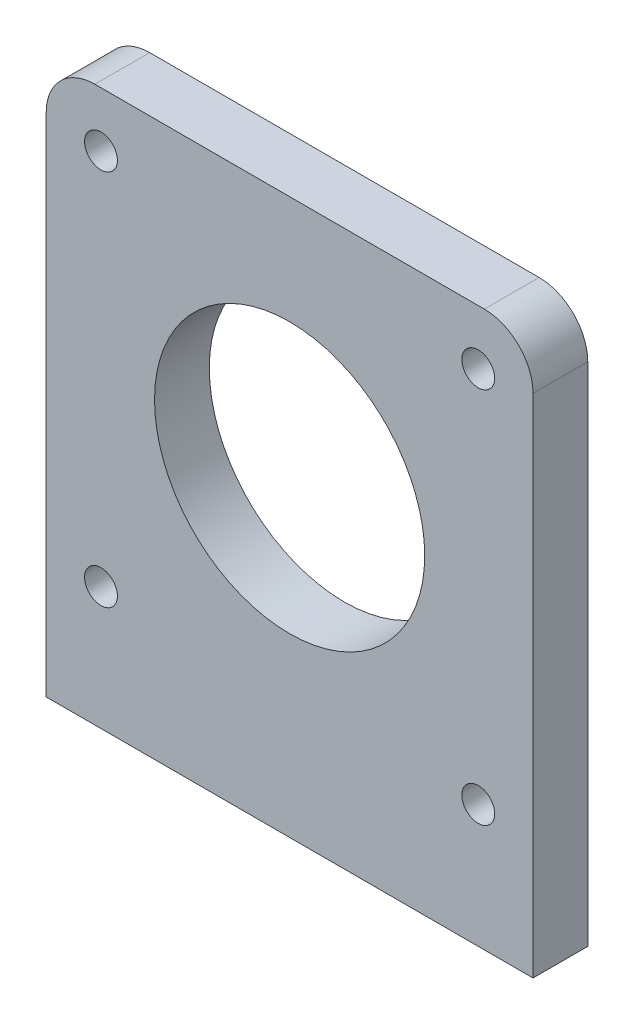
ISO-10303-21;
HEADER;
FILE_DESCRIPTION(('STEP AP214'),'2;1');
FILE_NAME('part.step','',(''),(''),'','','');
FILE_SCHEMA(('AUTOMOTIVE_DESIGN { 1 0 10303 214 1 1 1 1 }'));
ENDSEC;
DATA;
#1=APPLICATION_CONTEXT('core data for automotive mechanical design processes');
#2=APPLICATION_PROTOCOL_DEFINITION('international standard','automotive_design',2000,#1);
#3=PRODUCT_CONTEXT('',#1,'mechanical');
#4=PRODUCT('Part','Part','',(#3));
#5=PRODUCT_RELATED_PRODUCT_CATEGORY('part','',(#4));
#6=PRODUCT_DEFINITION_FORMATION('','',#4);
#7=PRODUCT_DEFINITION_CONTEXT('part definition',#1,'design');
#8=PRODUCT_DEFINITION('design','',#6,#7);
#9=PRODUCT_DEFINITION_SHAPE('','',#8);
#10=(LENGTH_UNIT() NAMED_UNIT(*) SI_UNIT(.MILLI.,.METRE.));
#11=(NAMED_UNIT(*) PLANE_ANGLE_UNIT() SI_UNIT($,.RADIAN.));
#12=(NAMED_UNIT(*) SI_UNIT($,.STERADIAN.) SOLID_ANGLE_UNIT());
#13=UNCERTAINTY_MEASURE_WITH_UNIT(LENGTH_MEASURE(1.E-05),#10,'distance_accuracy_value','');
#14=(GEOMETRIC_REPRESENTATION_CONTEXT(3) GLOBAL_UNCERTAINTY_ASSIGNED_CONTEXT((#13)) GLOBAL_UNIT_ASSIGNED_CONTEXT((#10,
#11,#12)) REPRESENTATION_CONTEXT('',''));
#15=CARTESIAN_POINT('',(0.,0.,0.));
#16=DIRECTION('',(0.,0.,1.));
#17=DIRECTION('',(1.,0.,0.));
#18=AXIS2_PLACEMENT_3D('',#15,#16,#17);
#19=CARTESIAN_POINT('',(20.,0.,4.5));
#20=DIRECTION('',(1.,0.,0.));
#21=DIRECTION('',(0.,1.,0.));
#22=AXIS2_PLACEMENT_3D('',#19,#20,#21);
#23=PLANE('',#22);
#24=DIRECTION('',(0.,-1.,0.));
#25=VECTOR('',#24,1.);
#26=CARTESIAN_POINT('',(20.,0.,0.));
#27=LINE('',#26,#25);
#28=CARTESIAN_POINT('',(20.,16.,0.));
#29=VERTEX_POINT('',#28);
#30=CARTESIAN_POINT('',(20.,-25.6,0.));
#31=VERTEX_POINT('',#30);
#32=EDGE_CURVE('E138',#29,#31,#27,.T.);
#33=ORIENTED_EDGE('',*,*,#32,.F.);
#34=DIRECTION('',(0.,0.,-1.));
#35=VECTOR('',#34,1.);
#36=CARTESIAN_POINT('',(20.,16.,4.5));
#37=LINE('',#36,#35);
#38=CARTESIAN_POINT('',(20.,16.,4.5));
#39=VERTEX_POINT('',#38);
#40=EDGE_CURVE('E66',#29,#39,#37,.F.);
#41=ORIENTED_EDGE('',*,*,#40,.T.);
#42=DIRECTION('',(0.,-1.,0.));
#43=VECTOR('',#42,1.);
#44=CARTESIAN_POINT('',(20.,0.,4.5));
#45=LINE('',#44,#43);
#46=CARTESIAN_POINT('',(20.,-25.6,4.5));
#47=VERTEX_POINT('',#46);
#48=EDGE_CURVE('E161',#39,#47,#45,.T.);
#49=ORIENTED_EDGE('',*,*,#48,.T.);
#50=DIRECTION('',(0.,0.,-1.));
#51=VECTOR('',#50,1.);
#52=CARTESIAN_POINT('',(20.,-25.6,4.5));
#53=LINE('',#52,#51);
#54=EDGE_CURVE('E116',#47,#31,#53,.T.);
#55=ORIENTED_EDGE('',*,*,#54,.T.);
#56=EDGE_LOOP('',(#33,#41,#49,#55));
#57=FACE_BOUND('',#56,.T.);
#58=ADVANCED_FACE('F43',(#57),#23,.T.);
#59=CARTESIAN_POINT('',(0.,20.,4.5));
#60=DIRECTION('',(0.,1.,0.));
#61=DIRECTION('',(0.,0.,1.));
#62=AXIS2_PLACEMENT_3D('',#59,#60,#61);
#63=PLANE('',#62);
#64=DIRECTION('',(1.,0.,0.));
#65=VECTOR('',#64,1.);
#66=CARTESIAN_POINT('',(0.,20.,4.5));
#67=LINE('',#66,#65);
#68=CARTESIAN_POINT('',(-16.,20.,4.5));
#69=VERTEX_POINT('',#68);
#70=CARTESIAN_POINT('',(16.,20.,4.5));
#71=VERTEX_POINT('',#70);
#72=EDGE_CURVE('E105',#69,#71,#67,.T.);
#73=ORIENTED_EDGE('',*,*,#72,.T.);
#74=DIRECTION('',(0.,0.,-1.));
#75=VECTOR('',#74,1.);
#76=CARTESIAN_POINT('',(16.,20.,4.5));
#77=LINE('',#76,#75);
#78=CARTESIAN_POINT('',(16.,20.,0.));
#79=VERTEX_POINT('',#78);
#80=EDGE_CURVE('E164',#71,#79,#77,.T.);
#81=ORIENTED_EDGE('',*,*,#80,.T.);
#82=DIRECTION('',(1.,0.,0.));
#83=VECTOR('',#82,1.);
#84=CARTESIAN_POINT('',(0.,20.,0.));
#85=LINE('',#84,#83);
#86=CARTESIAN_POINT('',(-16.,20.,0.));
#87=VERTEX_POINT('',#86);
#88=EDGE_CURVE('E140',#87,#79,#85,.T.);
#89=ORIENTED_EDGE('',*,*,#88,.F.);
#90=DIRECTION('',(0.,0.,-1.));
#91=VECTOR('',#90,1.);
#92=CARTESIAN_POINT('',(-16.,20.,4.5));
#93=LINE('',#92,#91);
#94=EDGE_CURVE('E115',#87,#69,#93,.F.);
#95=ORIENTED_EDGE('',*,*,#94,.T.);
#96=EDGE_LOOP('',(#73,#81,#89,#95));
#97=FACE_BOUND('',#96,.T.);
#98=ADVANCED_FACE('F177',(#97),#63,.T.);
#99=CARTESIAN_POINT('',(-20.,0.,4.5));
#100=DIRECTION('',(1.,0.,0.));
#101=DIRECTION('',(0.,0.,-1.));
#102=AXIS2_PLACEMENT_3D('',#99,#100,#101);
#103=PLANE('',#102);
#104=DIRECTION('',(0.,-1.,0.));
#105=VECTOR('',#104,1.);
#106=CARTESIAN_POINT('',(-20.,0.,4.5));
#107=LINE('',#106,#105);
#108=CARTESIAN_POINT('',(-20.,16.,4.5));
#109=VERTEX_POINT('',#108);
#110=CARTESIAN_POINT('',(-20.,-25.6,4.5));
#111=VERTEX_POINT('',#110);
#112=EDGE_CURVE('E96',#109,#111,#107,.T.);
#113=ORIENTED_EDGE('',*,*,#112,.F.);
#114=DIRECTION('',(0.,0.,-1.));
#115=VECTOR('',#114,1.);
#116=CARTESIAN_POINT('',(-20.,16.,0.));
#117=LINE('',#116,#115);
#118=CARTESIAN_POINT('',(-20.,16.,0.));
#119=VERTEX_POINT('',#118);
#120=EDGE_CURVE('E11',#109,#119,#117,.T.);
#121=ORIENTED_EDGE('',*,*,#120,.T.);
#122=DIRECTION('',(0.,-1.,0.));
#123=VECTOR('',#122,1.);
#124=CARTESIAN_POINT('',(-20.,0.,0.));
#125=LINE('',#124,#123);
#126=CARTESIAN_POINT('',(-20.,-25.6,0.));
#127=VERTEX_POINT('',#126);
#128=EDGE_CURVE('E111',#119,#127,#125,.T.);
#129=ORIENTED_EDGE('',*,*,#128,.T.);
#130=DIRECTION('',(0.,0.,-1.));
#131=VECTOR('',#130,1.);
#132=CARTESIAN_POINT('',(-20.,-25.6,4.5));
#133=LINE('',#132,#131);
#134=EDGE_CURVE('E108',#111,#127,#133,.T.);
#135=ORIENTED_EDGE('',*,*,#134,.F.);
#136=EDGE_LOOP('',(#113,#121,#129,#135));
#137=FACE_BOUND('',#136,.T.);
#138=ADVANCED_FACE('F109',(#137),#103,.F.);
#139=CARTESIAN_POINT('',(15.5000000000001,15.5,4.5));
#140=DIRECTION('',(0.,0.,-1.));
#141=DIRECTION('',(-1.,0.,0.));
#142=AXIS2_PLACEMENT_3D('',#139,#140,#141);
#143=CYLINDRICAL_SURFACE('',#142,1.35);
#144=CARTESIAN_POINT('',(15.5000000000001,15.5,4.5));
#145=DIRECTION('',(0.,0.,1.));
#146=DIRECTION('',(1.,0.,0.));
#147=AXIS2_PLACEMENT_3D('',#144,#145,#146);
#148=CIRCLE('',#147,1.35);
#149=CARTESIAN_POINT('',(16.8500000000001,15.5,4.5));
#150=VERTEX_POINT('',#149);
#151=EDGE_CURVE('E132',#150,#150,#148,.T.);
#152=ORIENTED_EDGE('',*,*,#151,.T.);
#153=EDGE_LOOP('',(#152));
#154=FACE_BOUND('',#153,.T.);
#155=CARTESIAN_POINT('',(15.5000000000001,15.5,0.));
#156=DIRECTION('',(0.,0.,1.));
#157=DIRECTION('',(1.,0.,0.));
#158=AXIS2_PLACEMENT_3D('',#155,#156,#157);
#159=CIRCLE('',#158,1.35);
#160=CARTESIAN_POINT('',(16.8500000000001,15.5,0.));
#161=VERTEX_POINT('',#160);
#162=EDGE_CURVE('E155',#161,#161,#159,.T.);
#163=ORIENTED_EDGE('',*,*,#162,.F.);
#164=EDGE_LOOP('',(#163));
#165=FACE_BOUND('',#164,.T.);
#166=ADVANCED_FACE('F199',(#154,#165),#143,.F.);
#167=CARTESIAN_POINT('',(15.5000000000001,-15.5000000000001,4.5));
#168=DIRECTION('',(0.,0.,-1.));
#169=DIRECTION('',(-1.,0.,0.));
#170=AXIS2_PLACEMENT_3D('',#167,#168,#169);
#171=CYLINDRICAL_SURFACE('',#170,1.35);
#172=CARTESIAN_POINT('',(15.5000000000001,-15.5000000000001,4.5));
#173=DIRECTION('',(0.,0.,1.));
#174=DIRECTION('',(1.,0.,0.));
#175=AXIS2_PLACEMENT_3D('',#172,#173,#174);
#176=CIRCLE('',#175,1.35);
#177=CARTESIAN_POINT('',(16.8500000000001,-15.5000000000001,4.5));
#178=VERTEX_POINT('',#177);
#179=EDGE_CURVE('E129',#178,#178,#176,.T.);
#180=ORIENTED_EDGE('',*,*,#179,.T.);
#181=EDGE_LOOP('',(#180));
#182=FACE_BOUND('',#181,.T.);
#183=CARTESIAN_POINT('',(15.5000000000001,-15.5000000000001,0.));
#184=DIRECTION('',(0.,0.,1.));
#185=DIRECTION('',(1.,0.,0.));
#186=AXIS2_PLACEMENT_3D('',#183,#184,#185);
#187=CIRCLE('',#186,1.35);
#188=CARTESIAN_POINT('',(16.8500000000001,-15.5000000000001,0.));
#189=VERTEX_POINT('',#188);
#190=EDGE_CURVE('E152',#189,#189,#187,.T.);
#191=ORIENTED_EDGE('',*,*,#190,.F.);
#192=EDGE_LOOP('',(#191));
#193=FACE_BOUND('',#192,.T.);
#194=ADVANCED_FACE('F210',(#182,#193),#171,.F.);
#195=CARTESIAN_POINT('',(-15.5000000000001,-15.5,4.5));
#196=DIRECTION('',(0.,0.,-1.));
#197=DIRECTION('',(-1.,0.,0.));
#198=AXIS2_PLACEMENT_3D('',#195,#196,#197);
#199=CYLINDRICAL_SURFACE('',#198,1.35);
#200=CARTESIAN_POINT('',(-15.5000000000001,-15.5,4.5));
#201=DIRECTION('',(0.,0.,1.));
#202=DIRECTION('',(1.,0.,0.));
#203=AXIS2_PLACEMENT_3D('',#200,#201,#202);
#204=CIRCLE('',#203,1.35);
#205=CARTESIAN_POINT('',(-14.1500000000001,-15.5,4.5));
#206=VERTEX_POINT('',#205);
#207=EDGE_CURVE('E123',#206,#206,#204,.T.);
#208=ORIENTED_EDGE('',*,*,#207,.T.);
#209=EDGE_LOOP('',(#208));
#210=FACE_BOUND('',#209,.T.);
#211=CARTESIAN_POINT('',(-15.5000000000001,-15.5,0.));
#212=DIRECTION('',(0.,0.,1.));
#213=DIRECTION('',(1.,0.,0.));
#214=AXIS2_PLACEMENT_3D('',#211,#212,#213);
#215=CIRCLE('',#214,1.35);
#216=CARTESIAN_POINT('',(-14.1500000000001,-15.5,0.));
#217=VERTEX_POINT('',#216);
#218=EDGE_CURVE('E149',#217,#217,#215,.T.);
#219=ORIENTED_EDGE('',*,*,#218,.F.);
#220=EDGE_LOOP('',(#219));
#221=FACE_BOUND('',#220,.T.);
#222=ADVANCED_FACE('F206',(#210,#221),#199,.F.);
#223=CARTESIAN_POINT('',(0.,0.,4.5));
#224=DIRECTION('',(0.,0.,-1.));
#225=DIRECTION('',(-1.,0.,0.));
#226=AXIS2_PLACEMENT_3D('',#223,#224,#225);
#227=CYLINDRICAL_SURFACE('',#226,11.1);
#228=CARTESIAN_POINT('',(0.,0.,4.5));
#229=DIRECTION('',(0.,0.,1.));
#230=DIRECTION('',(1.,0.,0.));
#231=AXIS2_PLACEMENT_3D('',#228,#229,#230);
#232=CIRCLE('',#231,11.1);
#233=CARTESIAN_POINT('',(11.1,0.,4.5));
#234=VERTEX_POINT('',#233);
#235=EDGE_CURVE('E120',#234,#234,#232,.T.);
#236=ORIENTED_EDGE('',*,*,#235,.T.);
#237=EDGE_LOOP('',(#236));
#238=FACE_BOUND('',#237,.T.);
#239=CARTESIAN_POINT('',(0.,0.,0.));
#240=DIRECTION('',(0.,0.,1.));
#241=DIRECTION('',(1.,0.,0.));
#242=AXIS2_PLACEMENT_3D('',#239,#240,#241);
#243=CIRCLE('',#242,11.1);
#244=CARTESIAN_POINT('',(11.1,0.,0.));
#245=VERTEX_POINT('',#244);
#246=EDGE_CURVE('E146',#245,#245,#243,.T.);
#247=ORIENTED_EDGE('',*,*,#246,.F.);
#248=EDGE_LOOP('',(#247));
#249=FACE_BOUND('',#248,.T.);
#250=ADVANCED_FACE('F203',(#238,#249),#227,.F.);
#251=CARTESIAN_POINT('',(0.,-25.6,4.5));
#252=DIRECTION('',(0.,1.,0.));
#253=DIRECTION('',(0.,0.,1.));
#254=AXIS2_PLACEMENT_3D('',#251,#252,#253);
#255=PLANE('',#254);
#256=DIRECTION('',(1.,0.,0.));
#257=VECTOR('',#256,1.);
#258=CARTESIAN_POINT('',(0.,-25.6,0.));
#259=LINE('',#258,#257);
#260=EDGE_CURVE('E144',#127,#31,#259,.T.);
#261=ORIENTED_EDGE('',*,*,#260,.T.);
#262=ORIENTED_EDGE('',*,*,#54,.F.);
#263=DIRECTION('',(1.,0.,0.));
#264=VECTOR('',#263,1.);
#265=CARTESIAN_POINT('',(0.,-25.6,4.5));
#266=LINE('',#265,#264);
#267=EDGE_CURVE('E101',#111,#47,#266,.T.);
#268=ORIENTED_EDGE('',*,*,#267,.F.);
#269=ORIENTED_EDGE('',*,*,#134,.T.);
#270=EDGE_LOOP('',(#261,#262,#268,#269));
#271=FACE_BOUND('',#270,.T.);
#272=ADVANCED_FACE('F118',(#271),#255,.F.);
#273=CARTESIAN_POINT('',(-15.5000000000001,15.5000000000001,4.5));
#274=DIRECTION('',(0.,0.,-1.));
#275=DIRECTION('',(-1.,0.,0.));
#276=AXIS2_PLACEMENT_3D('',#273,#274,#275);
#277=CYLINDRICAL_SURFACE('',#276,1.35);
#278=CARTESIAN_POINT('',(-15.5000000000001,15.5000000000001,4.5));
#279=DIRECTION('',(0.,0.,1.));
#280=DIRECTION('',(1.,0.,0.));
#281=AXIS2_PLACEMENT_3D('',#278,#279,#280);
#282=CIRCLE('',#281,1.35);
#283=CARTESIAN_POINT('',(-14.1500000000001,15.5000000000001,4.5));
#284=VERTEX_POINT('',#283);
#285=EDGE_CURVE('E135',#284,#284,#282,.T.);
#286=ORIENTED_EDGE('',*,*,#285,.T.);
#287=EDGE_LOOP('',(#286));
#288=FACE_BOUND('',#287,.T.);
#289=CARTESIAN_POINT('',(-15.5000000000001,15.5000000000001,0.));
#290=DIRECTION('',(0.,0.,1.));
#291=DIRECTION('',(1.,0.,0.));
#292=AXIS2_PLACEMENT_3D('',#289,#290,#291);
#293=CIRCLE('',#292,1.35);
#294=CARTESIAN_POINT('',(-14.1500000000001,15.5000000000001,0.));
#295=VERTEX_POINT('',#294);
#296=EDGE_CURVE('E158',#295,#295,#293,.T.);
#297=ORIENTED_EDGE('',*,*,#296,.F.);
#298=EDGE_LOOP('',(#297));
#299=FACE_BOUND('',#298,.T.);
#300=ADVANCED_FACE('F202',(#288,#299),#277,.F.);
#301=CARTESIAN_POINT('',(0.,0.,4.5));
#302=DIRECTION('',(0.,0.,1.));
#303=DIRECTION('',(1.,0.,0.));
#304=AXIS2_PLACEMENT_3D('',#301,#302,#303);
#305=PLANE('',#304);
#306=ORIENTED_EDGE('',*,*,#48,.F.);
#307=CARTESIAN_POINT('',(16.,16.,4.5));
#308=DIRECTION('',(0.,0.,1.));
#309=DIRECTION('',(1.,0.,0.));
#310=AXIS2_PLACEMENT_3D('',#307,#308,#309);
#311=CIRCLE('',#310,4.);
#312=EDGE_CURVE('E51',#39,#71,#311,.T.);
#313=ORIENTED_EDGE('',*,*,#312,.T.);
#314=ORIENTED_EDGE('',*,*,#72,.F.);
#315=CARTESIAN_POINT('',(-16.,16.,4.5));
#316=DIRECTION('',(0.,0.,1.));
#317=DIRECTION('',(1.,0.,0.));
#318=AXIS2_PLACEMENT_3D('',#315,#316,#317);
#319=CIRCLE('',#318,4.);
#320=EDGE_CURVE('E58',#69,#109,#319,.T.);
#321=ORIENTED_EDGE('',*,*,#320,.T.);
#322=ORIENTED_EDGE('',*,*,#112,.T.);
#323=ORIENTED_EDGE('',*,*,#267,.T.);
#324=EDGE_LOOP('',(#306,#313,#314,#321,#322,#323));
#325=FACE_BOUND('',#324,.T.);
#326=ORIENTED_EDGE('',*,*,#235,.F.);
#327=EDGE_LOOP('',(#326));
#328=FACE_BOUND('',#327,.T.);
#329=ORIENTED_EDGE('',*,*,#207,.F.);
#330=EDGE_LOOP('',(#329));
#331=FACE_BOUND('',#330,.T.);
#332=ORIENTED_EDGE('',*,*,#179,.F.);
#333=EDGE_LOOP('',(#332));
#334=FACE_BOUND('',#333,.T.);
#335=ORIENTED_EDGE('',*,*,#151,.F.);
#336=EDGE_LOOP('',(#335));
#337=FACE_BOUND('',#336,.T.);
#338=ORIENTED_EDGE('',*,*,#285,.F.);
#339=EDGE_LOOP('',(#338));
#340=FACE_BOUND('',#339,.T.);
#341=ADVANCED_FACE('F98',(#325,#328,#331,#334,#337,#340),#305,.T.);
#342=CARTESIAN_POINT('',(0.,0.,0.));
#343=DIRECTION('',(0.,0.,1.));
#344=DIRECTION('',(1.,0.,0.));
#345=AXIS2_PLACEMENT_3D('',#342,#343,#344);
#346=PLANE('',#345);
#347=ORIENTED_EDGE('',*,*,#88,.T.);
#348=CARTESIAN_POINT('',(16.,16.,0.));
#349=DIRECTION('',(0.,0.,1.));
#350=DIRECTION('',(1.,0.,0.));
#351=AXIS2_PLACEMENT_3D('',#348,#349,#350);
#352=CIRCLE('',#351,4.);
#353=EDGE_CURVE('E169',#79,#29,#352,.F.);
#354=ORIENTED_EDGE('',*,*,#353,.T.);
#355=ORIENTED_EDGE('',*,*,#32,.T.);
#356=ORIENTED_EDGE('',*,*,#260,.F.);
#357=ORIENTED_EDGE('',*,*,#128,.F.);
#358=CARTESIAN_POINT('',(-16.,16.,0.));
#359=DIRECTION('',(0.,0.,1.));
#360=DIRECTION('',(1.,0.,0.));
#361=AXIS2_PLACEMENT_3D('',#358,#359,#360);
#362=CIRCLE('',#361,4.);
#363=EDGE_CURVE('E167',#119,#87,#362,.F.);
#364=ORIENTED_EDGE('',*,*,#363,.T.);
#365=EDGE_LOOP('',(#347,#354,#355,#356,#357,#364));
#366=FACE_BOUND('',#365,.T.);
#367=ORIENTED_EDGE('',*,*,#246,.T.);
#368=EDGE_LOOP('',(#367));
#369=FACE_BOUND('',#368,.T.);
#370=ORIENTED_EDGE('',*,*,#218,.T.);
#371=EDGE_LOOP('',(#370));
#372=FACE_BOUND('',#371,.T.);
#373=ORIENTED_EDGE('',*,*,#190,.T.);
#374=EDGE_LOOP('',(#373));
#375=FACE_BOUND('',#374,.T.);
#376=ORIENTED_EDGE('',*,*,#162,.T.);
#377=EDGE_LOOP('',(#376));
#378=FACE_BOUND('',#377,.T.);
#379=ORIENTED_EDGE('',*,*,#296,.T.);
#380=EDGE_LOOP('',(#379));
#381=FACE_BOUND('',#380,.T.);
#382=ADVANCED_FACE('F182',(#366,#369,#372,#375,#378,#381),#346,.F.);
#383=CARTESIAN_POINT('',(16.,16.,4.5));
#384=DIRECTION('',(0.,0.,-1.));
#385=DIRECTION('',(-1.,0.,0.));
#386=AXIS2_PLACEMENT_3D('',#383,#384,#385);
#387=CYLINDRICAL_SURFACE('',#386,4.);
#388=ORIENTED_EDGE('',*,*,#312,.F.);
#389=ORIENTED_EDGE('',*,*,#40,.F.);
#390=ORIENTED_EDGE('',*,*,#353,.F.);
#391=ORIENTED_EDGE('',*,*,#80,.F.);
#392=EDGE_LOOP('',(#388,#389,#390,#391));
#393=FACE_BOUND('',#392,.T.);
#394=ADVANCED_FACE('F180',(#393),#387,.T.);
#395=CARTESIAN_POINT('',(-16.,16.,4.5));
#396=DIRECTION('',(0.,0.,1.));
#397=DIRECTION('',(1.,0.,0.));
#398=AXIS2_PLACEMENT_3D('',#395,#396,#397);
#399=CYLINDRICAL_SURFACE('',#398,4.);
#400=ORIENTED_EDGE('',*,*,#320,.F.);
#401=ORIENTED_EDGE('',*,*,#94,.F.);
#402=ORIENTED_EDGE('',*,*,#363,.F.);
#403=ORIENTED_EDGE('',*,*,#120,.F.);
#404=EDGE_LOOP('',(#400,#401,#402,#403));
#405=FACE_BOUND('',#404,.T.);
#406=ADVANCED_FACE('F45',(#405),#399,.T.);
#407=CLOSED_SHELL('',(#58,#98,#138,#166,#194,#222,#250,#272,#300,#341,#382,#394,#406));
#408=MANIFOLD_SOLID_BREP('B2',#407);
#409=ADVANCED_BREP_SHAPE_REPRESENTATION('',(#18,#408),#14);
#410=SHAPE_DEFINITION_REPRESENTATION(#9,#409);
ENDSEC;
END-ISO-10303-21;
